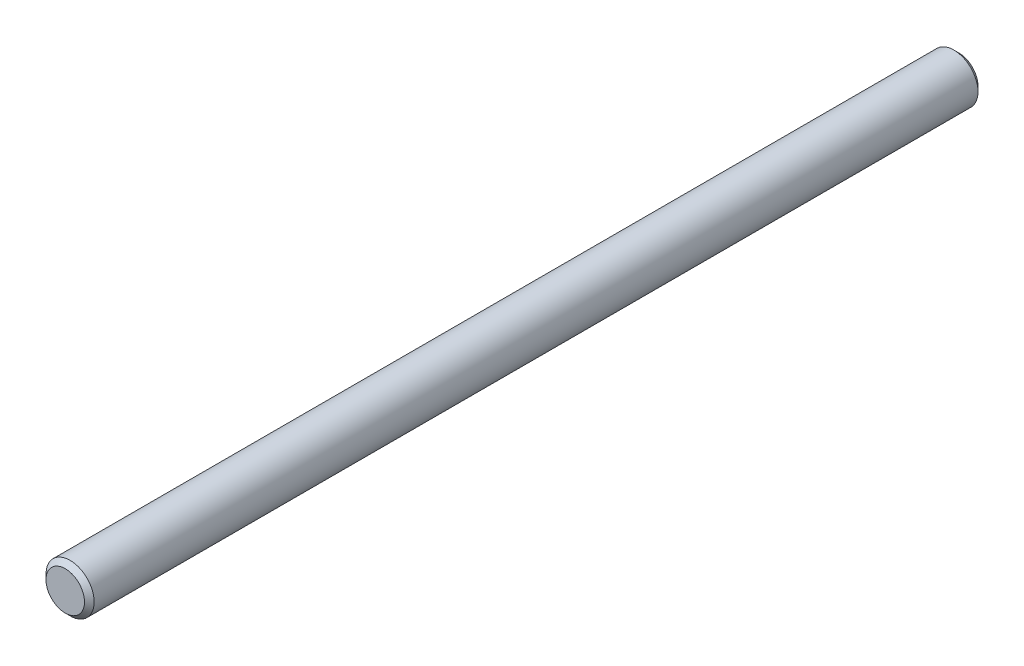
ISO-10303-21;
HEADER;
FILE_DESCRIPTION(('STEP AP214'),'2;1');
FILE_NAME('part.step','',(''),(''),'','','');
FILE_SCHEMA(('AUTOMOTIVE_DESIGN { 1 0 10303 214 1 1 1 1 }'));
ENDSEC;
DATA;
#1=APPLICATION_CONTEXT('core data for automotive mechanical design processes');
#2=APPLICATION_PROTOCOL_DEFINITION('international standard','automotive_design',2000,#1);
#3=PRODUCT_CONTEXT('',#1,'mechanical');
#4=PRODUCT('Part','Part','',(#3));
#5=PRODUCT_RELATED_PRODUCT_CATEGORY('part','',(#4));
#6=PRODUCT_DEFINITION_FORMATION('','',#4);
#7=PRODUCT_DEFINITION_CONTEXT('part definition',#1,'design');
#8=PRODUCT_DEFINITION('design','',#6,#7);
#9=PRODUCT_DEFINITION_SHAPE('','',#8);
#10=(LENGTH_UNIT() NAMED_UNIT(*) SI_UNIT(.MILLI.,.METRE.));
#11=(NAMED_UNIT(*) PLANE_ANGLE_UNIT() SI_UNIT($,.RADIAN.));
#12=(NAMED_UNIT(*) SI_UNIT($,.STERADIAN.) SOLID_ANGLE_UNIT());
#13=UNCERTAINTY_MEASURE_WITH_UNIT(LENGTH_MEASURE(1.E-05),#10,'distance_accuracy_value','');
#14=(GEOMETRIC_REPRESENTATION_CONTEXT(3) GLOBAL_UNCERTAINTY_ASSIGNED_CONTEXT((#13)) GLOBAL_UNIT_ASSIGNED_CONTEXT((#10,
#11,#12)) REPRESENTATION_CONTEXT('',''));
#15=CARTESIAN_POINT('',(0.,0.,0.));
#16=DIRECTION('',(0.,0.,1.));
#17=DIRECTION('',(1.,0.,0.));
#18=AXIS2_PLACEMENT_3D('',#15,#16,#17);
#19=CARTESIAN_POINT('',(0.,0.,294.64));
#20=DIRECTION('',(0.,0.,-1.));
#21=DIRECTION('',(-1.,0.,0.));
#22=AXIS2_PLACEMENT_3D('',#19,#20,#21);
#23=CYLINDRICAL_SURFACE('',#22,15.875);
#24=CARTESIAN_POINT('',(0.,0.,-291.465));
#25=DIRECTION('',(0.,0.,1.));
#26=DIRECTION('',(1.,0.,0.));
#27=AXIS2_PLACEMENT_3D('',#24,#25,#26);
#28=CIRCLE('',#27,15.875);
#29=CARTESIAN_POINT('',(15.875,0.,-291.465));
#30=VERTEX_POINT('',#29);
#31=EDGE_CURVE('E42',#30,#30,#28,.T.);
#32=ORIENTED_EDGE('',*,*,#31,.T.);
#33=EDGE_LOOP('',(#32));
#34=FACE_BOUND('',#33,.T.);
#35=CARTESIAN_POINT('',(0.,0.,291.465));
#36=DIRECTION('',(0.,0.,1.));
#37=DIRECTION('',(1.,0.,0.));
#38=AXIS2_PLACEMENT_3D('',#35,#36,#37);
#39=CIRCLE('',#38,15.875);
#40=CARTESIAN_POINT('',(15.875,0.,291.465));
#41=VERTEX_POINT('',#40);
#42=EDGE_CURVE('E46',#41,#41,#39,.F.);
#43=ORIENTED_EDGE('',*,*,#42,.T.);
#44=EDGE_LOOP('',(#43));
#45=FACE_BOUND('',#44,.T.);
#46=ADVANCED_FACE('F31',(#34,#45),#23,.T.);
#47=CARTESIAN_POINT('',(0.,0.,294.64));
#48=DIRECTION('',(0.,0.,1.));
#49=DIRECTION('',(1.,0.,0.));
#50=AXIS2_PLACEMENT_3D('',#47,#48,#49);
#51=PLANE('',#50);
#52=CARTESIAN_POINT('',(0.,0.,294.64));
#53=DIRECTION('',(0.,0.,1.));
#54=DIRECTION('',(1.,0.,0.));
#55=AXIS2_PLACEMENT_3D('',#52,#53,#54);
#56=CIRCLE('',#55,12.7);
#57=CARTESIAN_POINT('',(12.7,0.,294.64));
#58=VERTEX_POINT('',#57);
#59=EDGE_CURVE('E10',#58,#58,#56,.T.);
#60=ORIENTED_EDGE('',*,*,#59,.T.);
#61=EDGE_LOOP('',(#60));
#62=FACE_BOUND('',#61,.T.);
#63=ADVANCED_FACE('F62',(#62),#51,.T.);
#64=CARTESIAN_POINT('',(0.,0.,-294.64));
#65=DIRECTION('',(0.,0.,1.));
#66=DIRECTION('',(1.,0.,0.));
#67=AXIS2_PLACEMENT_3D('',#64,#65,#66);
#68=PLANE('',#67);
#69=CARTESIAN_POINT('',(0.,0.,-294.64));
#70=DIRECTION('',(0.,0.,1.));
#71=DIRECTION('',(1.,0.,0.));
#72=AXIS2_PLACEMENT_3D('',#69,#70,#71);
#73=CIRCLE('',#72,12.7);
#74=CARTESIAN_POINT('',(12.7,0.,-294.64));
#75=VERTEX_POINT('',#74);
#76=EDGE_CURVE('E38',#75,#75,#73,.F.);
#77=ORIENTED_EDGE('',*,*,#76,.T.);
#78=EDGE_LOOP('',(#77));
#79=FACE_BOUND('',#78,.T.);
#80=ADVANCED_FACE('F59',(#79),#68,.F.);
#81=CARTESIAN_POINT('',(0.,0.,-291.465));
#82=DIRECTION('',(0.,0.,1.));
#83=DIRECTION('',(1.,0.,0.));
#84=AXIS2_PLACEMENT_3D('',#81,#82,#83);
#85=CONICAL_SURFACE('',#84,15.875,0.785398163397444);
#86=ORIENTED_EDGE('',*,*,#76,.F.);
#87=EDGE_LOOP('',(#86));
#88=FACE_BOUND('',#87,.T.);
#89=ORIENTED_EDGE('',*,*,#31,.F.);
#90=EDGE_LOOP('',(#89));
#91=FACE_BOUND('',#90,.T.);
#92=ADVANCED_FACE('F55',(#88,#91),#85,.T.);
#93=CARTESIAN_POINT('',(0.,0.,294.64));
#94=DIRECTION('',(0.,0.,-1.));
#95=DIRECTION('',(-1.,0.,0.));
#96=AXIS2_PLACEMENT_3D('',#93,#94,#95);
#97=CONICAL_SURFACE('',#96,12.7,0.785398163397453);
#98=ORIENTED_EDGE('',*,*,#42,.F.);
#99=EDGE_LOOP('',(#98));
#100=FACE_BOUND('',#99,.T.);
#101=ORIENTED_EDGE('',*,*,#59,.F.);
#102=EDGE_LOOP('',(#101));
#103=FACE_BOUND('',#102,.T.);
#104=ADVANCED_FACE('F33',(#100,#103),#97,.T.);
#105=CLOSED_SHELL('',(#46,#63,#80,#92,#104));
#106=MANIFOLD_SOLID_BREP('B2',#105);
#107=ADVANCED_BREP_SHAPE_REPRESENTATION('',(#18,#106),#14);
#108=SHAPE_DEFINITION_REPRESENTATION(#9,#107);
ENDSEC;
END-ISO-10303-21;
